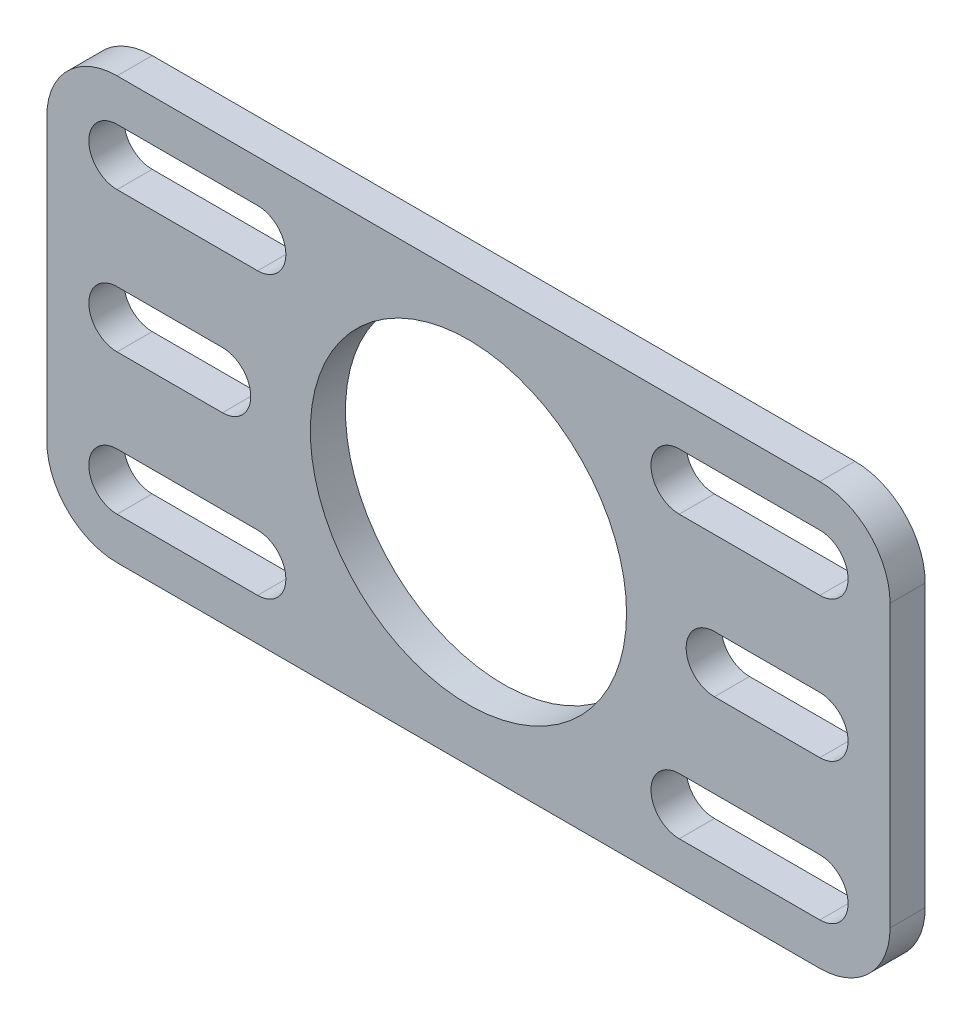
ISO-10303-21;
HEADER;
FILE_DESCRIPTION(('STEP AP214'),'2;1');
FILE_NAME('part.step','',(''),(''),'','','');
FILE_SCHEMA(('AUTOMOTIVE_DESIGN { 1 0 10303 214 1 1 1 1 }'));
ENDSEC;
DATA;
#1=APPLICATION_CONTEXT('core data for automotive mechanical design processes');
#2=APPLICATION_PROTOCOL_DEFINITION('international standard','automotive_design',2000,#1);
#3=PRODUCT_CONTEXT('',#1,'mechanical');
#4=PRODUCT('Part','Part','',(#3));
#5=PRODUCT_RELATED_PRODUCT_CATEGORY('part','',(#4));
#6=PRODUCT_DEFINITION_FORMATION('','',#4);
#7=PRODUCT_DEFINITION_CONTEXT('part definition',#1,'design');
#8=PRODUCT_DEFINITION('design','',#6,#7);
#9=PRODUCT_DEFINITION_SHAPE('','',#8);
#10=(LENGTH_UNIT() NAMED_UNIT(*) SI_UNIT(.MILLI.,.METRE.));
#11=(NAMED_UNIT(*) PLANE_ANGLE_UNIT() SI_UNIT($,.RADIAN.));
#12=(NAMED_UNIT(*) SI_UNIT($,.STERADIAN.) SOLID_ANGLE_UNIT());
#13=UNCERTAINTY_MEASURE_WITH_UNIT(LENGTH_MEASURE(1.E-05),#10,'distance_accuracy_value','');
#14=(GEOMETRIC_REPRESENTATION_CONTEXT(3) GLOBAL_UNCERTAINTY_ASSIGNED_CONTEXT((#13)) GLOBAL_UNIT_ASSIGNED_CONTEXT((#10,
#11,#12)) REPRESENTATION_CONTEXT('',''));
#15=CARTESIAN_POINT('',(0.,0.,0.));
#16=DIRECTION('',(0.,0.,1.));
#17=DIRECTION('',(1.,0.,0.));
#18=AXIS2_PLACEMENT_3D('',#15,#16,#17);
#19=CARTESIAN_POINT('',(0.,0.,0.));
#20=DIRECTION('',(0.,0.,1.));
#21=DIRECTION('',(1.,0.,0.));
#22=AXIS2_PLACEMENT_3D('',#19,#20,#21);
#23=PLANE('',#22);
#24=DIRECTION('',(1.,0.,0.));
#25=VECTOR('',#24,1.);
#26=CARTESIAN_POINT('',(-31.75,10.1473,0.));
#27=LINE('',#26,#25);
#28=CARTESIAN_POINT('',(-31.75,10.1473,0.));
#29=VERTEX_POINT('',#28);
#30=CARTESIAN_POINT('',(-19.05,10.1473,0.));
#31=VERTEX_POINT('',#30);
#32=EDGE_CURVE('E326',#29,#31,#27,.T.);
#33=ORIENTED_EDGE('',*,*,#32,.T.);
#34=CARTESIAN_POINT('',(-19.05,12.7,0.));
#35=DIRECTION('',(0.,0.,1.));
#36=DIRECTION('',(1.,0.,0.));
#37=AXIS2_PLACEMENT_3D('',#34,#35,#36);
#38=CIRCLE('',#37,2.5527);
#39=CARTESIAN_POINT('',(-19.05,15.2527,0.));
#40=VERTEX_POINT('',#39);
#41=EDGE_CURVE('E327',#31,#40,#38,.T.);
#42=ORIENTED_EDGE('',*,*,#41,.T.);
#43=DIRECTION('',(-1.,0.,0.));
#44=VECTOR('',#43,1.);
#45=CARTESIAN_POINT('',(-19.05,15.2527,0.));
#46=LINE('',#45,#44);
#47=CARTESIAN_POINT('',(-31.75,15.2527,0.));
#48=VERTEX_POINT('',#47);
#49=EDGE_CURVE('E395',#40,#48,#46,.T.);
#50=ORIENTED_EDGE('',*,*,#49,.T.);
#51=CARTESIAN_POINT('',(-31.75,12.7,0.));
#52=DIRECTION('',(0.,0.,1.));
#53=DIRECTION('',(1.,0.,0.));
#54=AXIS2_PLACEMENT_3D('',#51,#52,#53);
#55=CIRCLE('',#54,2.5527);
#56=EDGE_CURVE('E331',#48,#29,#55,.T.);
#57=ORIENTED_EDGE('',*,*,#56,.T.);
#58=EDGE_LOOP('',(#33,#42,#50,#57));
#59=FACE_BOUND('',#58,.T.);
#60=DIRECTION('',(-1.,0.,0.));
#61=VECTOR('',#60,1.);
#62=CARTESIAN_POINT('',(31.75,15.2527,0.));
#63=LINE('',#62,#61);
#64=CARTESIAN_POINT('',(31.75,15.2527,0.));
#65=VERTEX_POINT('',#64);
#66=CARTESIAN_POINT('',(19.05,15.2527,0.));
#67=VERTEX_POINT('',#66);
#68=EDGE_CURVE('E334',#65,#67,#63,.T.);
#69=ORIENTED_EDGE('',*,*,#68,.T.);
#70=CARTESIAN_POINT('',(19.05,12.7,0.));
#71=DIRECTION('',(0.,0.,1.));
#72=DIRECTION('',(1.,0.,0.));
#73=AXIS2_PLACEMENT_3D('',#70,#71,#72);
#74=CIRCLE('',#73,2.5527);
#75=CARTESIAN_POINT('',(19.05,10.1473,0.));
#76=VERTEX_POINT('',#75);
#77=EDGE_CURVE('E335',#67,#76,#74,.T.);
#78=ORIENTED_EDGE('',*,*,#77,.T.);
#79=DIRECTION('',(1.,0.,0.));
#80=VECTOR('',#79,1.);
#81=CARTESIAN_POINT('',(19.05,10.1473,0.));
#82=LINE('',#81,#80);
#83=CARTESIAN_POINT('',(31.75,10.1473,0.));
#84=VERTEX_POINT('',#83);
#85=EDGE_CURVE('E401',#76,#84,#82,.T.);
#86=ORIENTED_EDGE('',*,*,#85,.T.);
#87=CARTESIAN_POINT('',(31.75,12.7,0.));
#88=DIRECTION('',(0.,0.,1.));
#89=DIRECTION('',(1.,0.,0.));
#90=AXIS2_PLACEMENT_3D('',#87,#88,#89);
#91=CIRCLE('',#90,2.5527);
#92=EDGE_CURVE('E340',#84,#65,#91,.T.);
#93=ORIENTED_EDGE('',*,*,#92,.T.);
#94=EDGE_LOOP('',(#69,#78,#86,#93));
#95=FACE_BOUND('',#94,.T.);
#96=DIRECTION('',(-1.,0.,0.));
#97=VECTOR('',#96,1.);
#98=CARTESIAN_POINT('',(-19.05,-10.1473,0.));
#99=LINE('',#98,#97);
#100=CARTESIAN_POINT('',(-19.05,-10.1473,0.));
#101=VERTEX_POINT('',#100);
#102=CARTESIAN_POINT('',(-31.75,-10.1473,0.));
#103=VERTEX_POINT('',#102);
#104=EDGE_CURVE('E343',#101,#103,#99,.T.);
#105=ORIENTED_EDGE('',*,*,#104,.T.);
#106=CARTESIAN_POINT('',(-31.75,-12.7,0.));
#107=DIRECTION('',(0.,0.,1.));
#108=DIRECTION('',(1.,0.,0.));
#109=AXIS2_PLACEMENT_3D('',#106,#107,#108);
#110=CIRCLE('',#109,2.55269999999997);
#111=CARTESIAN_POINT('',(-31.75,-15.2527,0.));
#112=VERTEX_POINT('',#111);
#113=EDGE_CURVE('E344',#103,#112,#110,.T.);
#114=ORIENTED_EDGE('',*,*,#113,.T.);
#115=DIRECTION('',(1.,0.,0.));
#116=VECTOR('',#115,1.);
#117=CARTESIAN_POINT('',(-31.75,-15.2527,0.));
#118=LINE('',#117,#116);
#119=CARTESIAN_POINT('',(-19.05,-15.2527,0.));
#120=VERTEX_POINT('',#119);
#121=EDGE_CURVE('E407',#112,#120,#118,.T.);
#122=ORIENTED_EDGE('',*,*,#121,.T.);
#123=CARTESIAN_POINT('',(-19.05,-12.7,0.));
#124=DIRECTION('',(0.,0.,1.));
#125=DIRECTION('',(1.,0.,0.));
#126=AXIS2_PLACEMENT_3D('',#123,#124,#125);
#127=CIRCLE('',#126,2.55269999999997);
#128=EDGE_CURVE('E349',#120,#101,#127,.T.);
#129=ORIENTED_EDGE('',*,*,#128,.T.);
#130=EDGE_LOOP('',(#105,#114,#122,#129));
#131=FACE_BOUND('',#130,.T.);
#132=DIRECTION('',(1.,0.,0.));
#133=VECTOR('',#132,1.);
#134=CARTESIAN_POINT('',(19.05,-15.2527,0.));
#135=LINE('',#134,#133);
#136=CARTESIAN_POINT('',(19.05,-15.2527,0.));
#137=VERTEX_POINT('',#136);
#138=CARTESIAN_POINT('',(31.75,-15.2527,0.));
#139=VERTEX_POINT('',#138);
#140=EDGE_CURVE('E352',#137,#139,#135,.T.);
#141=ORIENTED_EDGE('',*,*,#140,.T.);
#142=CARTESIAN_POINT('',(31.75,-12.7,0.));
#143=DIRECTION('',(0.,0.,1.));
#144=DIRECTION('',(1.,0.,0.));
#145=AXIS2_PLACEMENT_3D('',#142,#143,#144);
#146=CIRCLE('',#145,2.55269999999997);
#147=CARTESIAN_POINT('',(31.75,-10.1473,0.));
#148=VERTEX_POINT('',#147);
#149=EDGE_CURVE('E353',#139,#148,#146,.T.);
#150=ORIENTED_EDGE('',*,*,#149,.T.);
#151=DIRECTION('',(-1.,0.,0.));
#152=VECTOR('',#151,1.);
#153=CARTESIAN_POINT('',(31.75,-10.1473,0.));
#154=LINE('',#153,#152);
#155=CARTESIAN_POINT('',(19.05,-10.1473,0.));
#156=VERTEX_POINT('',#155);
#157=EDGE_CURVE('E413',#148,#156,#154,.T.);
#158=ORIENTED_EDGE('',*,*,#157,.T.);
#159=CARTESIAN_POINT('',(19.05,-12.7,0.));
#160=DIRECTION('',(0.,0.,1.));
#161=DIRECTION('',(1.,0.,0.));
#162=AXIS2_PLACEMENT_3D('',#159,#160,#161);
#163=CIRCLE('',#162,2.55269999999997);
#164=EDGE_CURVE('E358',#156,#137,#163,.T.);
#165=ORIENTED_EDGE('',*,*,#164,.T.);
#166=EDGE_LOOP('',(#141,#150,#158,#165));
#167=FACE_BOUND('',#166,.T.);
#168=CARTESIAN_POINT('',(0.,0.,0.));
#169=DIRECTION('',(0.,0.,1.));
#170=DIRECTION('',(1.,0.,0.));
#171=AXIS2_PLACEMENT_3D('',#168,#169,#170);
#172=CIRCLE('',#171,14.2875);
#173=CARTESIAN_POINT('',(14.2875,0.,0.));
#174=VERTEX_POINT('',#173);
#175=EDGE_CURVE('E361',#174,#174,#172,.T.);
#176=ORIENTED_EDGE('',*,*,#175,.T.);
#177=EDGE_LOOP('',(#176));
#178=FACE_BOUND('',#177,.T.);
#179=DIRECTION('',(1.,0.,0.));
#180=VECTOR('',#179,1.);
#181=CARTESIAN_POINT('',(31.75,-2.55269999999997,0.));
#182=LINE('',#181,#180);
#183=CARTESIAN_POINT('',(22.225,-2.55269999999998,0.));
#184=VERTEX_POINT('',#183);
#185=CARTESIAN_POINT('',(31.75,-2.55269999999997,0.));
#186=VERTEX_POINT('',#185);
#187=EDGE_CURVE('E364',#184,#186,#182,.T.);
#188=ORIENTED_EDGE('',*,*,#187,.T.);
#189=CARTESIAN_POINT('',(31.75,0.,0.));
#190=DIRECTION('',(0.,0.,-1.));
#191=DIRECTION('',(-1.,0.,0.));
#192=AXIS2_PLACEMENT_3D('',#189,#190,#191);
#193=CIRCLE('',#192,2.55269999999997);
#194=CARTESIAN_POINT('',(31.75,2.55269999999998,0.));
#195=VERTEX_POINT('',#194);
#196=EDGE_CURVE('E365',#186,#195,#193,.F.);
#197=ORIENTED_EDGE('',*,*,#196,.T.);
#198=DIRECTION('',(-1.,0.,0.));
#199=VECTOR('',#198,1.);
#200=CARTESIAN_POINT('',(22.225,2.55269999999997,0.));
#201=LINE('',#200,#199);
#202=CARTESIAN_POINT('',(22.225,2.55269999999997,0.));
#203=VERTEX_POINT('',#202);
#204=EDGE_CURVE('E419',#195,#203,#201,.T.);
#205=ORIENTED_EDGE('',*,*,#204,.T.);
#206=CARTESIAN_POINT('',(22.225,0.,0.));
#207=DIRECTION('',(0.,0.,-1.));
#208=DIRECTION('',(-1.,0.,0.));
#209=AXIS2_PLACEMENT_3D('',#206,#207,#208);
#210=CIRCLE('',#209,2.55269999999997);
#211=EDGE_CURVE('E370',#203,#184,#210,.F.);
#212=ORIENTED_EDGE('',*,*,#211,.T.);
#213=EDGE_LOOP('',(#188,#197,#205,#212));
#214=FACE_BOUND('',#213,.T.);
#215=DIRECTION('',(-1.,0.,0.));
#216=VECTOR('',#215,1.);
#217=CARTESIAN_POINT('',(-31.75,2.5527,0.));
#218=LINE('',#217,#216);
#219=CARTESIAN_POINT('',(-22.225,2.55270000000001,0.));
#220=VERTEX_POINT('',#219);
#221=CARTESIAN_POINT('',(-31.75,2.5527,0.));
#222=VERTEX_POINT('',#221);
#223=EDGE_CURVE('E373',#220,#222,#218,.T.);
#224=ORIENTED_EDGE('',*,*,#223,.T.);
#225=CARTESIAN_POINT('',(-31.75,0.,0.));
#226=DIRECTION('',(0.,0.,-1.));
#227=DIRECTION('',(-1.,0.,0.));
#228=AXIS2_PLACEMENT_3D('',#225,#226,#227);
#229=CIRCLE('',#228,2.5527);
#230=CARTESIAN_POINT('',(-31.75,-2.55270000000001,0.));
#231=VERTEX_POINT('',#230);
#232=EDGE_CURVE('E374',#222,#231,#229,.F.);
#233=ORIENTED_EDGE('',*,*,#232,.T.);
#234=DIRECTION('',(1.,0.,0.));
#235=VECTOR('',#234,1.);
#236=CARTESIAN_POINT('',(-22.225,-2.5527,0.));
#237=LINE('',#236,#235);
#238=CARTESIAN_POINT('',(-22.225,-2.5527,0.));
#239=VERTEX_POINT('',#238);
#240=EDGE_CURVE('E251',#231,#239,#237,.T.);
#241=ORIENTED_EDGE('',*,*,#240,.T.);
#242=CARTESIAN_POINT('',(-22.225,0.,0.));
#243=DIRECTION('',(0.,0.,-1.));
#244=DIRECTION('',(-1.,0.,0.));
#245=AXIS2_PLACEMENT_3D('',#242,#243,#244);
#246=CIRCLE('',#245,2.5527);
#247=EDGE_CURVE('E244',#239,#220,#246,.F.);
#248=ORIENTED_EDGE('',*,*,#247,.T.);
#249=EDGE_LOOP('',(#224,#233,#241,#248));
#250=FACE_BOUND('',#249,.T.);
#251=DIRECTION('',(1.,0.,0.));
#252=VECTOR('',#251,1.);
#253=CARTESIAN_POINT('',(-38.1,-19.05,0.));
#254=LINE('',#253,#252);
#255=CARTESIAN_POINT('',(-31.75,-19.05,0.));
#256=VERTEX_POINT('',#255);
#257=CARTESIAN_POINT('',(31.75,-19.05,0.));
#258=VERTEX_POINT('',#257);
#259=EDGE_CURVE('E225',#256,#258,#254,.T.);
#260=ORIENTED_EDGE('',*,*,#259,.F.);
#261=CARTESIAN_POINT('',(-31.75,-12.7,0.));
#262=DIRECTION('',(0.,0.,1.));
#263=DIRECTION('',(1.,0.,0.));
#264=AXIS2_PLACEMENT_3D('',#261,#262,#263);
#265=CIRCLE('',#264,6.35);
#266=CARTESIAN_POINT('',(-38.1,-12.7,0.));
#267=VERTEX_POINT('',#266);
#268=EDGE_CURVE('E241',#267,#256,#265,.T.);
#269=ORIENTED_EDGE('',*,*,#268,.F.);
#270=DIRECTION('',(0.,-1.,0.));
#271=VECTOR('',#270,1.);
#272=CARTESIAN_POINT('',(-38.1,19.05,0.));
#273=LINE('',#272,#271);
#274=CARTESIAN_POINT('',(-38.1,12.7,0.));
#275=VERTEX_POINT('',#274);
#276=EDGE_CURVE('E253',#275,#267,#273,.T.);
#277=ORIENTED_EDGE('',*,*,#276,.F.);
#278=CARTESIAN_POINT('',(-31.75,12.7,0.));
#279=DIRECTION('',(0.,0.,1.));
#280=DIRECTION('',(1.,0.,0.));
#281=AXIS2_PLACEMENT_3D('',#278,#279,#280);
#282=CIRCLE('',#281,6.35);
#283=CARTESIAN_POINT('',(-31.75,19.05,0.));
#284=VERTEX_POINT('',#283);
#285=EDGE_CURVE('E380',#284,#275,#282,.T.);
#286=ORIENTED_EDGE('',*,*,#285,.F.);
#287=DIRECTION('',(-1.,0.,0.));
#288=VECTOR('',#287,1.);
#289=CARTESIAN_POINT('',(38.1,19.05,0.));
#290=LINE('',#289,#288);
#291=CARTESIAN_POINT('',(31.75,19.05,0.));
#292=VERTEX_POINT('',#291);
#293=EDGE_CURVE('E257',#292,#284,#290,.T.);
#294=ORIENTED_EDGE('',*,*,#293,.F.);
#295=CARTESIAN_POINT('',(31.75,12.7,0.));
#296=DIRECTION('',(0.,0.,1.));
#297=DIRECTION('',(1.,0.,0.));
#298=AXIS2_PLACEMENT_3D('',#295,#296,#297);
#299=CIRCLE('',#298,6.35);
#300=CARTESIAN_POINT('',(38.1,12.7,0.));
#301=VERTEX_POINT('',#300);
#302=EDGE_CURVE('E381',#301,#292,#299,.T.);
#303=ORIENTED_EDGE('',*,*,#302,.F.);
#304=DIRECTION('',(0.,1.,0.));
#305=VECTOR('',#304,1.);
#306=CARTESIAN_POINT('',(38.1,-19.05,0.));
#307=LINE('',#306,#305);
#308=CARTESIAN_POINT('',(38.1,-12.7,0.));
#309=VERTEX_POINT('',#308);
#310=EDGE_CURVE('E228',#309,#301,#307,.T.);
#311=ORIENTED_EDGE('',*,*,#310,.F.);
#312=CARTESIAN_POINT('',(31.75,-12.7,0.));
#313=DIRECTION('',(0.,0.,1.));
#314=DIRECTION('',(1.,0.,0.));
#315=AXIS2_PLACEMENT_3D('',#312,#313,#314);
#316=CIRCLE('',#315,6.35);
#317=EDGE_CURVE('E18',#258,#309,#316,.T.);
#318=ORIENTED_EDGE('',*,*,#317,.F.);
#319=EDGE_LOOP('',(#260,#269,#277,#286,#294,#303,#311,#318));
#320=FACE_BOUND('',#319,.T.);
#321=ADVANCED_FACE('F15',(#59,#95,#131,#167,#178,#214,#250,#320),#23,.F.);
#322=CARTESIAN_POINT('',(31.75,-12.7,0.));
#323=DIRECTION('',(0.,0.,1.));
#324=DIRECTION('',(1.,0.,0.));
#325=AXIS2_PLACEMENT_3D('',#322,#323,#324);
#326=CYLINDRICAL_SURFACE('',#325,6.35);
#327=ORIENTED_EDGE('',*,*,#317,.T.);
#328=DIRECTION('',(0.,0.,1.));
#329=VECTOR('',#328,1.);
#330=CARTESIAN_POINT('',(38.1,-12.7,0.));
#331=LINE('',#330,#329);
#332=CARTESIAN_POINT('',(38.1,-12.7,3.175));
#333=VERTEX_POINT('',#332);
#334=EDGE_CURVE('E231',#333,#309,#331,.F.);
#335=ORIENTED_EDGE('',*,*,#334,.F.);
#336=CARTESIAN_POINT('',(31.75,-12.7,3.175));
#337=DIRECTION('',(0.,0.,1.));
#338=DIRECTION('',(1.,0.,0.));
#339=AXIS2_PLACEMENT_3D('',#336,#337,#338);
#340=CIRCLE('',#339,6.35);
#341=CARTESIAN_POINT('',(31.75,-19.05,3.175));
#342=VERTEX_POINT('',#341);
#343=EDGE_CURVE('E236',#342,#333,#340,.T.);
#344=ORIENTED_EDGE('',*,*,#343,.F.);
#345=DIRECTION('',(0.,0.,-1.));
#346=VECTOR('',#345,1.);
#347=CARTESIAN_POINT('',(31.75,-19.05,0.));
#348=LINE('',#347,#346);
#349=EDGE_CURVE('E233',#258,#342,#348,.F.);
#350=ORIENTED_EDGE('',*,*,#349,.F.);
#351=EDGE_LOOP('',(#327,#335,#344,#350));
#352=FACE_BOUND('',#351,.T.);
#353=ADVANCED_FACE('F234',(#352),#326,.T.);
#354=CARTESIAN_POINT('',(38.1,-19.05,0.));
#355=DIRECTION('',(1.,0.,0.));
#356=DIRECTION('',(0.,1.,0.));
#357=AXIS2_PLACEMENT_3D('',#354,#355,#356);
#358=PLANE('',#357);
#359=DIRECTION('',(0.,0.,1.));
#360=VECTOR('',#359,1.);
#361=CARTESIAN_POINT('',(38.1,12.7,0.));
#362=LINE('',#361,#360);
#363=CARTESIAN_POINT('',(38.1,12.7,3.175));
#364=VERTEX_POINT('',#363);
#365=EDGE_CURVE('E262',#364,#301,#362,.F.);
#366=ORIENTED_EDGE('',*,*,#365,.F.);
#367=DIRECTION('',(0.,1.,0.));
#368=VECTOR('',#367,1.);
#369=CARTESIAN_POINT('',(38.1,0.,3.175));
#370=LINE('',#369,#368);
#371=EDGE_CURVE('E324',#333,#364,#370,.T.);
#372=ORIENTED_EDGE('',*,*,#371,.F.);
#373=ORIENTED_EDGE('',*,*,#334,.T.);
#374=ORIENTED_EDGE('',*,*,#310,.T.);
#375=EDGE_LOOP('',(#366,#372,#373,#374));
#376=FACE_BOUND('',#375,.T.);
#377=ADVANCED_FACE('F631',(#376),#358,.T.);
#378=CARTESIAN_POINT('',(31.75,12.7,0.));
#379=DIRECTION('',(0.,0.,1.));
#380=DIRECTION('',(1.,0.,0.));
#381=AXIS2_PLACEMENT_3D('',#378,#379,#380);
#382=CYLINDRICAL_SURFACE('',#381,6.35);
#383=ORIENTED_EDGE('',*,*,#302,.T.);
#384=DIRECTION('',(0.,0.,1.));
#385=VECTOR('',#384,1.);
#386=CARTESIAN_POINT('',(31.75,19.05,0.));
#387=LINE('',#386,#385);
#388=CARTESIAN_POINT('',(31.75,19.05,3.175));
#389=VERTEX_POINT('',#388);
#390=EDGE_CURVE('E260',#389,#292,#387,.F.);
#391=ORIENTED_EDGE('',*,*,#390,.F.);
#392=CARTESIAN_POINT('',(31.75,12.7,3.175));
#393=DIRECTION('',(0.,0.,1.));
#394=DIRECTION('',(1.,0.,0.));
#395=AXIS2_PLACEMENT_3D('',#392,#393,#394);
#396=CIRCLE('',#395,6.35);
#397=EDGE_CURVE('E321',#364,#389,#396,.T.);
#398=ORIENTED_EDGE('',*,*,#397,.F.);
#399=ORIENTED_EDGE('',*,*,#365,.T.);
#400=EDGE_LOOP('',(#383,#391,#398,#399));
#401=FACE_BOUND('',#400,.T.);
#402=ADVANCED_FACE('F688',(#401),#382,.T.);
#403=CARTESIAN_POINT('',(38.1,19.05,0.));
#404=DIRECTION('',(0.,1.,0.));
#405=DIRECTION('',(-1.,0.,0.));
#406=AXIS2_PLACEMENT_3D('',#403,#404,#405);
#407=PLANE('',#406);
#408=ORIENTED_EDGE('',*,*,#390,.T.);
#409=ORIENTED_EDGE('',*,*,#293,.T.);
#410=DIRECTION('',(0.,0.,1.));
#411=VECTOR('',#410,1.);
#412=CARTESIAN_POINT('',(-31.75,19.05,0.));
#413=LINE('',#412,#411);
#414=CARTESIAN_POINT('',(-31.75,19.05,3.175));
#415=VERTEX_POINT('',#414);
#416=EDGE_CURVE('E259',#415,#284,#413,.F.);
#417=ORIENTED_EDGE('',*,*,#416,.F.);
#418=DIRECTION('',(1.,0.,0.));
#419=VECTOR('',#418,1.);
#420=CARTESIAN_POINT('',(0.,19.05,3.175));
#421=LINE('',#420,#419);
#422=EDGE_CURVE('E320',#389,#415,#421,.F.);
#423=ORIENTED_EDGE('',*,*,#422,.F.);
#424=EDGE_LOOP('',(#408,#409,#417,#423));
#425=FACE_BOUND('',#424,.T.);
#426=ADVANCED_FACE('F447',(#425),#407,.T.);
#427=CARTESIAN_POINT('',(-31.75,12.7,0.));
#428=DIRECTION('',(0.,0.,1.));
#429=DIRECTION('',(1.,0.,0.));
#430=AXIS2_PLACEMENT_3D('',#427,#428,#429);
#431=CYLINDRICAL_SURFACE('',#430,6.35);
#432=ORIENTED_EDGE('',*,*,#285,.T.);
#433=DIRECTION('',(0.,0.,1.));
#434=VECTOR('',#433,1.);
#435=CARTESIAN_POINT('',(-38.1,12.7,0.));
#436=LINE('',#435,#434);
#437=CARTESIAN_POINT('',(-38.1,12.7,3.175));
#438=VERTEX_POINT('',#437);
#439=EDGE_CURVE('E256',#438,#275,#436,.F.);
#440=ORIENTED_EDGE('',*,*,#439,.F.);
#441=CARTESIAN_POINT('',(-31.75,12.7,3.175));
#442=DIRECTION('',(0.,0.,1.));
#443=DIRECTION('',(1.,0.,0.));
#444=AXIS2_PLACEMENT_3D('',#441,#442,#443);
#445=CIRCLE('',#444,6.35);
#446=EDGE_CURVE('E317',#415,#438,#445,.T.);
#447=ORIENTED_EDGE('',*,*,#446,.F.);
#448=ORIENTED_EDGE('',*,*,#416,.T.);
#449=EDGE_LOOP('',(#432,#440,#447,#448));
#450=FACE_BOUND('',#449,.T.);
#451=ADVANCED_FACE('F441',(#450),#431,.T.);
#452=CARTESIAN_POINT('',(-38.1,19.05,0.));
#453=DIRECTION('',(-1.,0.,0.));
#454=DIRECTION('',(0.,-1.,0.));
#455=AXIS2_PLACEMENT_3D('',#452,#453,#454);
#456=PLANE('',#455);
#457=ORIENTED_EDGE('',*,*,#439,.T.);
#458=ORIENTED_EDGE('',*,*,#276,.T.);
#459=DIRECTION('',(0.,0.,1.));
#460=VECTOR('',#459,1.);
#461=CARTESIAN_POINT('',(-38.1,-12.7,0.));
#462=LINE('',#461,#460);
#463=CARTESIAN_POINT('',(-38.1,-12.7,3.175));
#464=VERTEX_POINT('',#463);
#465=EDGE_CURVE('E255',#464,#267,#462,.F.);
#466=ORIENTED_EDGE('',*,*,#465,.F.);
#467=DIRECTION('',(0.,1.,0.));
#468=VECTOR('',#467,1.);
#469=CARTESIAN_POINT('',(-38.1,0.,3.175));
#470=LINE('',#469,#468);
#471=EDGE_CURVE('E316',#438,#464,#470,.F.);
#472=ORIENTED_EDGE('',*,*,#471,.F.);
#473=EDGE_LOOP('',(#457,#458,#466,#472));
#474=FACE_BOUND('',#473,.T.);
#475=ADVANCED_FACE('F450',(#474),#456,.T.);
#476=CARTESIAN_POINT('',(-31.75,-12.7,0.));
#477=DIRECTION('',(0.,0.,1.));
#478=DIRECTION('',(1.,0.,0.));
#479=AXIS2_PLACEMENT_3D('',#476,#477,#478);
#480=CYLINDRICAL_SURFACE('',#479,6.35);
#481=ORIENTED_EDGE('',*,*,#268,.T.);
#482=DIRECTION('',(0.,0.,-1.));
#483=VECTOR('',#482,1.);
#484=CARTESIAN_POINT('',(-31.75,-19.05,0.));
#485=LINE('',#484,#483);
#486=CARTESIAN_POINT('',(-31.75,-19.05,3.175));
#487=VERTEX_POINT('',#486);
#488=EDGE_CURVE('E240',#487,#256,#485,.T.);
#489=ORIENTED_EDGE('',*,*,#488,.F.);
#490=CARTESIAN_POINT('',(-31.75,-12.7,3.175));
#491=DIRECTION('',(0.,0.,1.));
#492=DIRECTION('',(1.,0.,0.));
#493=AXIS2_PLACEMENT_3D('',#490,#491,#492);
#494=CIRCLE('',#493,6.35);
#495=EDGE_CURVE('E313',#464,#487,#494,.T.);
#496=ORIENTED_EDGE('',*,*,#495,.F.);
#497=ORIENTED_EDGE('',*,*,#465,.T.);
#498=EDGE_LOOP('',(#481,#489,#496,#497));
#499=FACE_BOUND('',#498,.T.);
#500=ADVANCED_FACE('F509',(#499),#480,.T.);
#501=CARTESIAN_POINT('',(-38.1,-19.05,0.));
#502=DIRECTION('',(0.,-1.,0.));
#503=DIRECTION('',(0.,0.,-1.));
#504=AXIS2_PLACEMENT_3D('',#501,#502,#503);
#505=PLANE('',#504);
#506=ORIENTED_EDGE('',*,*,#488,.T.);
#507=ORIENTED_EDGE('',*,*,#259,.T.);
#508=ORIENTED_EDGE('',*,*,#349,.T.);
#509=DIRECTION('',(1.,0.,0.));
#510=VECTOR('',#509,1.);
#511=CARTESIAN_POINT('',(0.,-19.05,3.175));
#512=LINE('',#511,#510);
#513=EDGE_CURVE('E312',#487,#342,#512,.T.);
#514=ORIENTED_EDGE('',*,*,#513,.F.);
#515=EDGE_LOOP('',(#506,#507,#508,#514));
#516=FACE_BOUND('',#515,.T.);
#517=ADVANCED_FACE('F243',(#516),#505,.T.);
#518=CARTESIAN_POINT('',(-22.225,0.,3.175));
#519=DIRECTION('',(0.,0.,-1.));
#520=DIRECTION('',(-1.,0.,0.));
#521=AXIS2_PLACEMENT_3D('',#518,#519,#520);
#522=CYLINDRICAL_SURFACE('',#521,2.5527);
#523=DIRECTION('',(0.,0.,1.));
#524=VECTOR('',#523,1.);
#525=CARTESIAN_POINT('',(-22.225,-2.5527,3.175));
#526=LINE('',#525,#524);
#527=CARTESIAN_POINT('',(-22.225,-2.5527,3.175));
#528=VERTEX_POINT('',#527);
#529=EDGE_CURVE('E246',#239,#528,#526,.T.);
#530=ORIENTED_EDGE('',*,*,#529,.T.);
#531=CARTESIAN_POINT('',(-22.225,0.,3.175));
#532=DIRECTION('',(0.,0.,-1.));
#533=DIRECTION('',(-1.,0.,0.));
#534=AXIS2_PLACEMENT_3D('',#531,#532,#533);
#535=CIRCLE('',#534,2.5527);
#536=CARTESIAN_POINT('',(-22.225,2.5527,3.175));
#537=VERTEX_POINT('',#536);
#538=EDGE_CURVE('E309',#537,#528,#535,.T.);
#539=ORIENTED_EDGE('',*,*,#538,.F.);
#540=DIRECTION('',(0.,0.,1.));
#541=VECTOR('',#540,1.);
#542=CARTESIAN_POINT('',(-22.225,2.55270000000001,3.175));
#543=LINE('',#542,#541);
#544=EDGE_CURVE('E422',#537,#220,#543,.F.);
#545=ORIENTED_EDGE('',*,*,#544,.T.);
#546=ORIENTED_EDGE('',*,*,#247,.F.);
#547=EDGE_LOOP('',(#530,#539,#545,#546));
#548=FACE_BOUND('',#547,.T.);
#549=ADVANCED_FACE('F517',(#548),#522,.F.);
#550=CARTESIAN_POINT('',(-22.225,-2.5527,3.175));
#551=DIRECTION('',(0.,-1.,0.));
#552=DIRECTION('',(1.,0.,0.));
#553=AXIS2_PLACEMENT_3D('',#550,#551,#552);
#554=PLANE('',#553);
#555=DIRECTION('',(0.,0.,-1.));
#556=VECTOR('',#555,1.);
#557=CARTESIAN_POINT('',(-31.75,-2.55270000000001,3.175));
#558=LINE('',#557,#556);
#559=CARTESIAN_POINT('',(-31.75,-2.5527,3.175));
#560=VERTEX_POINT('',#559);
#561=EDGE_CURVE('E377',#231,#560,#558,.F.);
#562=ORIENTED_EDGE('',*,*,#561,.T.);
#563=DIRECTION('',(1.,0.,0.));
#564=VECTOR('',#563,1.);
#565=CARTESIAN_POINT('',(0.,-2.5527,3.175));
#566=LINE('',#565,#564);
#567=EDGE_CURVE('E308',#528,#560,#566,.F.);
#568=ORIENTED_EDGE('',*,*,#567,.F.);
#569=ORIENTED_EDGE('',*,*,#529,.F.);
#570=ORIENTED_EDGE('',*,*,#240,.F.);
#571=EDGE_LOOP('',(#562,#568,#569,#570));
#572=FACE_BOUND('',#571,.T.);
#573=ADVANCED_FACE('F612',(#572),#554,.F.);
#574=CARTESIAN_POINT('',(-31.75,0.,3.175));
#575=DIRECTION('',(0.,0.,-1.));
#576=DIRECTION('',(-1.,0.,0.));
#577=AXIS2_PLACEMENT_3D('',#574,#575,#576);
#578=CYLINDRICAL_SURFACE('',#577,2.5527);
#579=DIRECTION('',(0.,0.,1.));
#580=VECTOR('',#579,1.);
#581=CARTESIAN_POINT('',(-31.75,2.5527,3.175));
#582=LINE('',#581,#580);
#583=CARTESIAN_POINT('',(-31.75,2.5527,3.175));
#584=VERTEX_POINT('',#583);
#585=EDGE_CURVE('E376',#222,#584,#582,.T.);
#586=ORIENTED_EDGE('',*,*,#585,.T.);
#587=CARTESIAN_POINT('',(-31.75,0.,3.175));
#588=DIRECTION('',(0.,0.,-1.));
#589=DIRECTION('',(-1.,0.,0.));
#590=AXIS2_PLACEMENT_3D('',#587,#588,#589);
#591=CIRCLE('',#590,2.5527);
#592=EDGE_CURVE('E305',#560,#584,#591,.T.);
#593=ORIENTED_EDGE('',*,*,#592,.F.);
#594=ORIENTED_EDGE('',*,*,#561,.F.);
#595=ORIENTED_EDGE('',*,*,#232,.F.);
#596=EDGE_LOOP('',(#586,#593,#594,#595));
#597=FACE_BOUND('',#596,.T.);
#598=ADVANCED_FACE('F608',(#597),#578,.F.);
#599=CARTESIAN_POINT('',(-31.75,2.5527,3.175));
#600=DIRECTION('',(0.,1.,0.));
#601=DIRECTION('',(-1.,0.,0.));
#602=AXIS2_PLACEMENT_3D('',#599,#600,#601);
#603=PLANE('',#602);
#604=ORIENTED_EDGE('',*,*,#544,.F.);
#605=DIRECTION('',(1.,0.,0.));
#606=VECTOR('',#605,1.);
#607=CARTESIAN_POINT('',(0.,2.5527,3.175));
#608=LINE('',#607,#606);
#609=EDGE_CURVE('E304',#584,#537,#608,.T.);
#610=ORIENTED_EDGE('',*,*,#609,.F.);
#611=ORIENTED_EDGE('',*,*,#585,.F.);
#612=ORIENTED_EDGE('',*,*,#223,.F.);
#613=EDGE_LOOP('',(#604,#610,#611,#612));
#614=FACE_BOUND('',#613,.T.);
#615=ADVANCED_FACE('F605',(#614),#603,.F.);
#616=CARTESIAN_POINT('',(22.225,0.,3.175));
#617=DIRECTION('',(0.,0.,-1.));
#618=DIRECTION('',(-1.,0.,0.));
#619=AXIS2_PLACEMENT_3D('',#616,#617,#618);
#620=CYLINDRICAL_SURFACE('',#619,2.55269999999997);
#621=DIRECTION('',(0.,0.,1.));
#622=VECTOR('',#621,1.);
#623=CARTESIAN_POINT('',(22.225,2.55269999999997,3.175));
#624=LINE('',#623,#622);
#625=CARTESIAN_POINT('',(22.225,2.55269999999997,3.175));
#626=VERTEX_POINT('',#625);
#627=EDGE_CURVE('E372',#203,#626,#624,.T.);
#628=ORIENTED_EDGE('',*,*,#627,.T.);
#629=CARTESIAN_POINT('',(22.225,0.,3.175));
#630=DIRECTION('',(0.,0.,-1.));
#631=DIRECTION('',(-1.,0.,0.));
#632=AXIS2_PLACEMENT_3D('',#629,#630,#631);
#633=CIRCLE('',#632,2.55269999999997);
#634=CARTESIAN_POINT('',(22.225,-2.55269999999998,3.175));
#635=VERTEX_POINT('',#634);
#636=EDGE_CURVE('E301',#635,#626,#633,.T.);
#637=ORIENTED_EDGE('',*,*,#636,.F.);
#638=DIRECTION('',(0.,0.,1.));
#639=VECTOR('',#638,1.);
#640=CARTESIAN_POINT('',(22.225,-2.55269999999998,3.175));
#641=LINE('',#640,#639);
#642=EDGE_CURVE('E418',#635,#184,#641,.F.);
#643=ORIENTED_EDGE('',*,*,#642,.T.);
#644=ORIENTED_EDGE('',*,*,#211,.F.);
#645=EDGE_LOOP('',(#628,#637,#643,#644));
#646=FACE_BOUND('',#645,.T.);
#647=ADVANCED_FACE('F487',(#646),#620,.F.);
#648=CARTESIAN_POINT('',(22.225,2.55269999999997,3.175));
#649=DIRECTION('',(0.,1.,0.));
#650=DIRECTION('',(-1.,0.,0.));
#651=AXIS2_PLACEMENT_3D('',#648,#649,#650);
#652=PLANE('',#651);
#653=DIRECTION('',(0.,0.,-1.));
#654=VECTOR('',#653,1.);
#655=CARTESIAN_POINT('',(31.75,2.55269999999998,3.175));
#656=LINE('',#655,#654);
#657=CARTESIAN_POINT('',(31.75,2.55269999999998,3.175));
#658=VERTEX_POINT('',#657);
#659=EDGE_CURVE('E369',#195,#658,#656,.F.);
#660=ORIENTED_EDGE('',*,*,#659,.T.);
#661=DIRECTION('',(1.,0.,0.));
#662=VECTOR('',#661,1.);
#663=CARTESIAN_POINT('',(0.,2.55269999999997,3.175));
#664=LINE('',#663,#662);
#665=EDGE_CURVE('E300',#626,#658,#664,.T.);
#666=ORIENTED_EDGE('',*,*,#665,.F.);
#667=ORIENTED_EDGE('',*,*,#627,.F.);
#668=ORIENTED_EDGE('',*,*,#204,.F.);
#669=EDGE_LOOP('',(#660,#666,#667,#668));
#670=FACE_BOUND('',#669,.T.);
#671=ADVANCED_FACE('F491',(#670),#652,.F.);
#672=CARTESIAN_POINT('',(31.75,0.,3.175));
#673=DIRECTION('',(0.,0.,-1.));
#674=DIRECTION('',(-1.,0.,0.));
#675=AXIS2_PLACEMENT_3D('',#672,#673,#674);
#676=CYLINDRICAL_SURFACE('',#675,2.55269999999997);
#677=DIRECTION('',(0.,0.,1.));
#678=VECTOR('',#677,1.);
#679=CARTESIAN_POINT('',(31.75,-2.55269999999997,3.175));
#680=LINE('',#679,#678);
#681=CARTESIAN_POINT('',(31.75,-2.55269999999997,3.175));
#682=VERTEX_POINT('',#681);
#683=EDGE_CURVE('E368',#186,#682,#680,.T.);
#684=ORIENTED_EDGE('',*,*,#683,.T.);
#685=CARTESIAN_POINT('',(31.75,0.,3.175));
#686=DIRECTION('',(0.,0.,-1.));
#687=DIRECTION('',(-1.,0.,0.));
#688=AXIS2_PLACEMENT_3D('',#685,#686,#687);
#689=CIRCLE('',#688,2.55269999999997);
#690=EDGE_CURVE('E297',#658,#682,#689,.T.);
#691=ORIENTED_EDGE('',*,*,#690,.F.);
#692=ORIENTED_EDGE('',*,*,#659,.F.);
#693=ORIENTED_EDGE('',*,*,#196,.F.);
#694=EDGE_LOOP('',(#684,#691,#692,#693));
#695=FACE_BOUND('',#694,.T.);
#696=ADVANCED_FACE('F597',(#695),#676,.F.);
#697=CARTESIAN_POINT('',(31.75,-2.55269999999997,3.175));
#698=DIRECTION('',(0.,-1.,0.));
#699=DIRECTION('',(1.,0.,0.));
#700=AXIS2_PLACEMENT_3D('',#697,#698,#699);
#701=PLANE('',#700);
#702=ORIENTED_EDGE('',*,*,#642,.F.);
#703=DIRECTION('',(1.,0.,0.));
#704=VECTOR('',#703,1.);
#705=CARTESIAN_POINT('',(0.,-2.55269999999997,3.175));
#706=LINE('',#705,#704);
#707=EDGE_CURVE('E296',#682,#635,#706,.F.);
#708=ORIENTED_EDGE('',*,*,#707,.F.);
#709=ORIENTED_EDGE('',*,*,#683,.F.);
#710=ORIENTED_EDGE('',*,*,#187,.F.);
#711=EDGE_LOOP('',(#702,#708,#709,#710));
#712=FACE_BOUND('',#711,.T.);
#713=ADVANCED_FACE('F593',(#712),#701,.F.);
#714=CARTESIAN_POINT('',(0.,0.,0.));
#715=DIRECTION('',(0.,0.,1.));
#716=DIRECTION('',(1.,0.,0.));
#717=AXIS2_PLACEMENT_3D('',#714,#715,#716);
#718=CYLINDRICAL_SURFACE('',#717,14.2875);
#719=ORIENTED_EDGE('',*,*,#175,.F.);
#720=EDGE_LOOP('',(#719));
#721=FACE_BOUND('',#720,.T.);
#722=CARTESIAN_POINT('',(0.,0.,3.175));
#723=DIRECTION('',(0.,0.,1.));
#724=DIRECTION('',(1.,0.,0.));
#725=AXIS2_PLACEMENT_3D('',#722,#723,#724);
#726=CIRCLE('',#725,14.2875);
#727=CARTESIAN_POINT('',(14.2875,0.,3.175));
#728=VERTEX_POINT('',#727);
#729=EDGE_CURVE('E293',#728,#728,#726,.F.);
#730=ORIENTED_EDGE('',*,*,#729,.F.);
#731=EDGE_LOOP('',(#730));
#732=FACE_BOUND('',#731,.T.);
#733=ADVANCED_FACE('F589',(#721,#732),#718,.F.);
#734=CARTESIAN_POINT('',(19.05,-12.7,0.));
#735=DIRECTION('',(0.,0.,1.));
#736=DIRECTION('',(1.,0.,0.));
#737=AXIS2_PLACEMENT_3D('',#734,#735,#736);
#738=CYLINDRICAL_SURFACE('',#737,2.55269999999997);
#739=DIRECTION('',(0.,0.,1.));
#740=VECTOR('',#739,1.);
#741=CARTESIAN_POINT('',(19.05,-10.1473,0.));
#742=LINE('',#741,#740);
#743=CARTESIAN_POINT('',(19.05,-10.1473,3.175));
#744=VERTEX_POINT('',#743);
#745=EDGE_CURVE('E360',#156,#744,#742,.T.);
#746=ORIENTED_EDGE('',*,*,#745,.T.);
#747=CARTESIAN_POINT('',(19.05,-12.7,3.175));
#748=DIRECTION('',(0.,0.,1.));
#749=DIRECTION('',(1.,0.,0.));
#750=AXIS2_PLACEMENT_3D('',#747,#748,#749);
#751=CIRCLE('',#750,2.55269999999997);
#752=CARTESIAN_POINT('',(19.05,-15.2527,3.175));
#753=VERTEX_POINT('',#752);
#754=EDGE_CURVE('E290',#753,#744,#751,.F.);
#755=ORIENTED_EDGE('',*,*,#754,.F.);
#756=DIRECTION('',(0.,0.,1.));
#757=VECTOR('',#756,1.);
#758=CARTESIAN_POINT('',(19.05,-15.2527,0.));
#759=LINE('',#758,#757);
#760=EDGE_CURVE('E412',#753,#137,#759,.F.);
#761=ORIENTED_EDGE('',*,*,#760,.T.);
#762=ORIENTED_EDGE('',*,*,#164,.F.);
#763=EDGE_LOOP('',(#746,#755,#761,#762));
#764=FACE_BOUND('',#763,.T.);
#765=ADVANCED_FACE('F585',(#764),#738,.F.);
#766=CARTESIAN_POINT('',(31.75,-10.1473,0.));
#767=DIRECTION('',(0.,1.,0.));
#768=DIRECTION('',(-1.,0.,0.));
#769=AXIS2_PLACEMENT_3D('',#766,#767,#768);
#770=PLANE('',#769);
#771=DIRECTION('',(0.,0.,1.));
#772=VECTOR('',#771,1.);
#773=CARTESIAN_POINT('',(31.75,-10.1473,0.));
#774=LINE('',#773,#772);
#775=CARTESIAN_POINT('',(31.75,-10.1473,3.175));
#776=VERTEX_POINT('',#775);
#777=EDGE_CURVE('E357',#148,#776,#774,.T.);
#778=ORIENTED_EDGE('',*,*,#777,.T.);
#779=DIRECTION('',(1.,0.,0.));
#780=VECTOR('',#779,1.);
#781=CARTESIAN_POINT('',(0.,-10.1473,3.175));
#782=LINE('',#781,#780);
#783=EDGE_CURVE('E289',#744,#776,#782,.T.);
#784=ORIENTED_EDGE('',*,*,#783,.F.);
#785=ORIENTED_EDGE('',*,*,#745,.F.);
#786=ORIENTED_EDGE('',*,*,#157,.F.);
#787=EDGE_LOOP('',(#778,#784,#785,#786));
#788=FACE_BOUND('',#787,.T.);
#789=ADVANCED_FACE('F581',(#788),#770,.F.);
#790=CARTESIAN_POINT('',(31.75,-12.7,0.));
#791=DIRECTION('',(0.,0.,1.));
#792=DIRECTION('',(1.,0.,0.));
#793=AXIS2_PLACEMENT_3D('',#790,#791,#792);
#794=CYLINDRICAL_SURFACE('',#793,2.55269999999997);
#795=DIRECTION('',(0.,0.,1.));
#796=VECTOR('',#795,1.);
#797=CARTESIAN_POINT('',(31.75,-15.2527,0.));
#798=LINE('',#797,#796);
#799=CARTESIAN_POINT('',(31.75,-15.2527,3.175));
#800=VERTEX_POINT('',#799);
#801=EDGE_CURVE('E356',#139,#800,#798,.T.);
#802=ORIENTED_EDGE('',*,*,#801,.T.);
#803=CARTESIAN_POINT('',(31.75,-12.7,3.175));
#804=DIRECTION('',(0.,0.,1.));
#805=DIRECTION('',(1.,0.,0.));
#806=AXIS2_PLACEMENT_3D('',#803,#804,#805);
#807=CIRCLE('',#806,2.55269999999997);
#808=EDGE_CURVE('E286',#776,#800,#807,.F.);
#809=ORIENTED_EDGE('',*,*,#808,.F.);
#810=ORIENTED_EDGE('',*,*,#777,.F.);
#811=ORIENTED_EDGE('',*,*,#149,.F.);
#812=EDGE_LOOP('',(#802,#809,#810,#811));
#813=FACE_BOUND('',#812,.T.);
#814=ADVANCED_FACE('F577',(#813),#794,.F.);
#815=CARTESIAN_POINT('',(19.05,-15.2527,0.));
#816=DIRECTION('',(0.,-1.,0.));
#817=DIRECTION('',(1.,0.,0.));
#818=AXIS2_PLACEMENT_3D('',#815,#816,#817);
#819=PLANE('',#818);
#820=ORIENTED_EDGE('',*,*,#760,.F.);
#821=DIRECTION('',(1.,0.,0.));
#822=VECTOR('',#821,1.);
#823=CARTESIAN_POINT('',(0.,-15.2527,3.175));
#824=LINE('',#823,#822);
#825=EDGE_CURVE('E285',#800,#753,#824,.F.);
#826=ORIENTED_EDGE('',*,*,#825,.F.);
#827=ORIENTED_EDGE('',*,*,#801,.F.);
#828=ORIENTED_EDGE('',*,*,#140,.F.);
#829=EDGE_LOOP('',(#820,#826,#827,#828));
#830=FACE_BOUND('',#829,.T.);
#831=ADVANCED_FACE('F573',(#830),#819,.F.);
#832=CARTESIAN_POINT('',(-19.05,-12.7,0.));
#833=DIRECTION('',(0.,0.,1.));
#834=DIRECTION('',(1.,0.,0.));
#835=AXIS2_PLACEMENT_3D('',#832,#833,#834);
#836=CYLINDRICAL_SURFACE('',#835,2.55269999999997);
#837=DIRECTION('',(0.,0.,1.));
#838=VECTOR('',#837,1.);
#839=CARTESIAN_POINT('',(-19.05,-15.2527,0.));
#840=LINE('',#839,#838);
#841=CARTESIAN_POINT('',(-19.05,-15.2527,3.175));
#842=VERTEX_POINT('',#841);
#843=EDGE_CURVE('E351',#120,#842,#840,.T.);
#844=ORIENTED_EDGE('',*,*,#843,.T.);
#845=CARTESIAN_POINT('',(-19.05,-12.7,3.175));
#846=DIRECTION('',(0.,0.,1.));
#847=DIRECTION('',(1.,0.,0.));
#848=AXIS2_PLACEMENT_3D('',#845,#846,#847);
#849=CIRCLE('',#848,2.55269999999997);
#850=CARTESIAN_POINT('',(-19.05,-10.1473,3.175));
#851=VERTEX_POINT('',#850);
#852=EDGE_CURVE('E282',#851,#842,#849,.F.);
#853=ORIENTED_EDGE('',*,*,#852,.F.);
#854=DIRECTION('',(0.,0.,1.));
#855=VECTOR('',#854,1.);
#856=CARTESIAN_POINT('',(-19.05,-10.1473,0.));
#857=LINE('',#856,#855);
#858=EDGE_CURVE('E406',#851,#101,#857,.F.);
#859=ORIENTED_EDGE('',*,*,#858,.T.);
#860=ORIENTED_EDGE('',*,*,#128,.F.);
#861=EDGE_LOOP('',(#844,#853,#859,#860));
#862=FACE_BOUND('',#861,.T.);
#863=ADVANCED_FACE('F569',(#862),#836,.F.);
#864=CARTESIAN_POINT('',(-31.75,-15.2527,0.));
#865=DIRECTION('',(0.,-1.,0.));
#866=DIRECTION('',(1.,0.,0.));
#867=AXIS2_PLACEMENT_3D('',#864,#865,#866);
#868=PLANE('',#867);
#869=DIRECTION('',(0.,0.,1.));
#870=VECTOR('',#869,1.);
#871=CARTESIAN_POINT('',(-31.75,-15.2527,0.));
#872=LINE('',#871,#870);
#873=CARTESIAN_POINT('',(-31.75,-15.2527,3.175));
#874=VERTEX_POINT('',#873);
#875=EDGE_CURVE('E348',#112,#874,#872,.T.);
#876=ORIENTED_EDGE('',*,*,#875,.T.);
#877=DIRECTION('',(1.,0.,0.));
#878=VECTOR('',#877,1.);
#879=CARTESIAN_POINT('',(0.,-15.2527,3.175));
#880=LINE('',#879,#878);
#881=EDGE_CURVE('E281',#842,#874,#880,.F.);
#882=ORIENTED_EDGE('',*,*,#881,.F.);
#883=ORIENTED_EDGE('',*,*,#843,.F.);
#884=ORIENTED_EDGE('',*,*,#121,.F.);
#885=EDGE_LOOP('',(#876,#882,#883,#884));
#886=FACE_BOUND('',#885,.T.);
#887=ADVANCED_FACE('F565',(#886),#868,.F.);
#888=CARTESIAN_POINT('',(-31.75,-12.7,0.));
#889=DIRECTION('',(0.,0.,1.));
#890=DIRECTION('',(1.,0.,0.));
#891=AXIS2_PLACEMENT_3D('',#888,#889,#890);
#892=CYLINDRICAL_SURFACE('',#891,2.55269999999997);
#893=DIRECTION('',(0.,0.,1.));
#894=VECTOR('',#893,1.);
#895=CARTESIAN_POINT('',(-31.75,-10.1473,0.));
#896=LINE('',#895,#894);
#897=CARTESIAN_POINT('',(-31.75,-10.1473,3.175));
#898=VERTEX_POINT('',#897);
#899=EDGE_CURVE('E347',#103,#898,#896,.T.);
#900=ORIENTED_EDGE('',*,*,#899,.T.);
#901=CARTESIAN_POINT('',(-31.75,-12.7,3.175));
#902=DIRECTION('',(0.,0.,1.));
#903=DIRECTION('',(1.,0.,0.));
#904=AXIS2_PLACEMENT_3D('',#901,#902,#903);
#905=CIRCLE('',#904,2.55269999999997);
#906=EDGE_CURVE('E278',#874,#898,#905,.F.);
#907=ORIENTED_EDGE('',*,*,#906,.F.);
#908=ORIENTED_EDGE('',*,*,#875,.F.);
#909=ORIENTED_EDGE('',*,*,#113,.F.);
#910=EDGE_LOOP('',(#900,#907,#908,#909));
#911=FACE_BOUND('',#910,.T.);
#912=ADVANCED_FACE('F561',(#911),#892,.F.);
#913=CARTESIAN_POINT('',(-19.05,-10.1473,0.));
#914=DIRECTION('',(0.,1.,0.));
#915=DIRECTION('',(-1.,0.,0.));
#916=AXIS2_PLACEMENT_3D('',#913,#914,#915);
#917=PLANE('',#916);
#918=ORIENTED_EDGE('',*,*,#858,.F.);
#919=DIRECTION('',(1.,0.,0.));
#920=VECTOR('',#919,1.);
#921=CARTESIAN_POINT('',(0.,-10.1473,3.175));
#922=LINE('',#921,#920);
#923=EDGE_CURVE('E277',#898,#851,#922,.T.);
#924=ORIENTED_EDGE('',*,*,#923,.F.);
#925=ORIENTED_EDGE('',*,*,#899,.F.);
#926=ORIENTED_EDGE('',*,*,#104,.F.);
#927=EDGE_LOOP('',(#918,#924,#925,#926));
#928=FACE_BOUND('',#927,.T.);
#929=ADVANCED_FACE('F557',(#928),#917,.F.);
#930=CARTESIAN_POINT('',(31.75,12.7,0.));
#931=DIRECTION('',(0.,0.,1.));
#932=DIRECTION('',(1.,0.,0.));
#933=AXIS2_PLACEMENT_3D('',#930,#931,#932);
#934=CYLINDRICAL_SURFACE('',#933,2.5527);
#935=DIRECTION('',(0.,0.,-1.));
#936=VECTOR('',#935,1.);
#937=CARTESIAN_POINT('',(31.75,10.1473,0.));
#938=LINE('',#937,#936);
#939=CARTESIAN_POINT('',(31.75,10.1473,3.175));
#940=VERTEX_POINT('',#939);
#941=EDGE_CURVE('E342',#84,#940,#938,.F.);
#942=ORIENTED_EDGE('',*,*,#941,.T.);
#943=CARTESIAN_POINT('',(31.75,12.7,3.175));
#944=DIRECTION('',(0.,0.,1.));
#945=DIRECTION('',(1.,0.,0.));
#946=AXIS2_PLACEMENT_3D('',#943,#944,#945);
#947=CIRCLE('',#946,2.5527);
#948=CARTESIAN_POINT('',(31.75,15.2527,3.175));
#949=VERTEX_POINT('',#948);
#950=EDGE_CURVE('E274',#949,#940,#947,.F.);
#951=ORIENTED_EDGE('',*,*,#950,.F.);
#952=DIRECTION('',(0.,0.,1.));
#953=VECTOR('',#952,1.);
#954=CARTESIAN_POINT('',(31.75,15.2527,0.));
#955=LINE('',#954,#953);
#956=EDGE_CURVE('E400',#949,#65,#955,.F.);
#957=ORIENTED_EDGE('',*,*,#956,.T.);
#958=ORIENTED_EDGE('',*,*,#92,.F.);
#959=EDGE_LOOP('',(#942,#951,#957,#958));
#960=FACE_BOUND('',#959,.T.);
#961=ADVANCED_FACE('F553',(#960),#934,.F.);
#962=CARTESIAN_POINT('',(19.05,10.1473,0.));
#963=DIRECTION('',(0.,-1.,0.));
#964=DIRECTION('',(0.,0.,-1.));
#965=AXIS2_PLACEMENT_3D('',#962,#963,#964);
#966=PLANE('',#965);
#967=DIRECTION('',(0.,0.,1.));
#968=VECTOR('',#967,1.);
#969=CARTESIAN_POINT('',(19.05,10.1473,0.));
#970=LINE('',#969,#968);
#971=CARTESIAN_POINT('',(19.05,10.1473,3.175));
#972=VERTEX_POINT('',#971);
#973=EDGE_CURVE('E339',#76,#972,#970,.T.);
#974=ORIENTED_EDGE('',*,*,#973,.T.);
#975=DIRECTION('',(1.,0.,0.));
#976=VECTOR('',#975,1.);
#977=CARTESIAN_POINT('',(0.,10.1473,3.175));
#978=LINE('',#977,#976);
#979=EDGE_CURVE('E273',#940,#972,#978,.F.);
#980=ORIENTED_EDGE('',*,*,#979,.F.);
#981=ORIENTED_EDGE('',*,*,#941,.F.);
#982=ORIENTED_EDGE('',*,*,#85,.F.);
#983=EDGE_LOOP('',(#974,#980,#981,#982));
#984=FACE_BOUND('',#983,.T.);
#985=ADVANCED_FACE('F549',(#984),#966,.F.);
#986=CARTESIAN_POINT('',(19.05,12.7,0.));
#987=DIRECTION('',(0.,0.,1.));
#988=DIRECTION('',(1.,0.,0.));
#989=AXIS2_PLACEMENT_3D('',#986,#987,#988);
#990=CYLINDRICAL_SURFACE('',#989,2.5527);
#991=DIRECTION('',(0.,0.,1.));
#992=VECTOR('',#991,1.);
#993=CARTESIAN_POINT('',(19.05,15.2527,0.));
#994=LINE('',#993,#992);
#995=CARTESIAN_POINT('',(19.05,15.2527,3.175));
#996=VERTEX_POINT('',#995);
#997=EDGE_CURVE('E338',#67,#996,#994,.T.);
#998=ORIENTED_EDGE('',*,*,#997,.T.);
#999=CARTESIAN_POINT('',(19.05,12.7,3.175));
#1000=DIRECTION('',(0.,0.,1.));
#1001=DIRECTION('',(1.,0.,0.));
#1002=AXIS2_PLACEMENT_3D('',#999,#1000,#1001);
#1003=CIRCLE('',#1002,2.5527);
#1004=EDGE_CURVE('E270',#972,#996,#1003,.F.);
#1005=ORIENTED_EDGE('',*,*,#1004,.F.);
#1006=ORIENTED_EDGE('',*,*,#973,.F.);
#1007=ORIENTED_EDGE('',*,*,#77,.F.);
#1008=EDGE_LOOP('',(#998,#1005,#1006,#1007));
#1009=FACE_BOUND('',#1008,.T.);
#1010=ADVANCED_FACE('F545',(#1009),#990,.F.);
#1011=CARTESIAN_POINT('',(31.75,15.2527,0.));
#1012=DIRECTION('',(0.,1.,0.));
#1013=DIRECTION('',(-1.,0.,0.));
#1014=AXIS2_PLACEMENT_3D('',#1011,#1012,#1013);
#1015=PLANE('',#1014);
#1016=ORIENTED_EDGE('',*,*,#956,.F.);
#1017=DIRECTION('',(1.,0.,0.));
#1018=VECTOR('',#1017,1.);
#1019=CARTESIAN_POINT('',(0.,15.2527,3.175));
#1020=LINE('',#1019,#1018);
#1021=EDGE_CURVE('E269',#996,#949,#1020,.T.);
#1022=ORIENTED_EDGE('',*,*,#1021,.F.);
#1023=ORIENTED_EDGE('',*,*,#997,.F.);
#1024=ORIENTED_EDGE('',*,*,#68,.F.);
#1025=EDGE_LOOP('',(#1016,#1022,#1023,#1024));
#1026=FACE_BOUND('',#1025,.T.);
#1027=ADVANCED_FACE('F541',(#1026),#1015,.F.);
#1028=CARTESIAN_POINT('',(-31.75,12.7,0.));
#1029=DIRECTION('',(0.,0.,1.));
#1030=DIRECTION('',(1.,0.,0.));
#1031=AXIS2_PLACEMENT_3D('',#1028,#1029,#1030);
#1032=CYLINDRICAL_SURFACE('',#1031,2.5527);
#1033=DIRECTION('',(0.,0.,1.));
#1034=VECTOR('',#1033,1.);
#1035=CARTESIAN_POINT('',(-31.75,15.2527,0.));
#1036=LINE('',#1035,#1034);
#1037=CARTESIAN_POINT('',(-31.75,15.2527,3.175));
#1038=VERTEX_POINT('',#1037);
#1039=EDGE_CURVE('E333',#48,#1038,#1036,.T.);
#1040=ORIENTED_EDGE('',*,*,#1039,.T.);
#1041=CARTESIAN_POINT('',(-31.75,12.7,3.175));
#1042=DIRECTION('',(0.,0.,1.));
#1043=DIRECTION('',(1.,0.,0.));
#1044=AXIS2_PLACEMENT_3D('',#1041,#1042,#1043);
#1045=CIRCLE('',#1044,2.5527);
#1046=CARTESIAN_POINT('',(-31.75,10.1473,3.175));
#1047=VERTEX_POINT('',#1046);
#1048=EDGE_CURVE('E266',#1047,#1038,#1045,.F.);
#1049=ORIENTED_EDGE('',*,*,#1048,.F.);
#1050=DIRECTION('',(0.,0.,-1.));
#1051=VECTOR('',#1050,1.);
#1052=CARTESIAN_POINT('',(-31.75,10.1473,0.));
#1053=LINE('',#1052,#1051);
#1054=EDGE_CURVE('E394',#1047,#29,#1053,.T.);
#1055=ORIENTED_EDGE('',*,*,#1054,.T.);
#1056=ORIENTED_EDGE('',*,*,#56,.F.);
#1057=EDGE_LOOP('',(#1040,#1049,#1055,#1056));
#1058=FACE_BOUND('',#1057,.T.);
#1059=ADVANCED_FACE('F537',(#1058),#1032,.F.);
#1060=CARTESIAN_POINT('',(-19.05,15.2527,0.));
#1061=DIRECTION('',(0.,1.,0.));
#1062=DIRECTION('',(-1.,0.,0.));
#1063=AXIS2_PLACEMENT_3D('',#1060,#1061,#1062);
#1064=PLANE('',#1063);
#1065=DIRECTION('',(0.,0.,1.));
#1066=VECTOR('',#1065,1.);
#1067=CARTESIAN_POINT('',(-19.05,15.2527,0.));
#1068=LINE('',#1067,#1066);
#1069=CARTESIAN_POINT('',(-19.05,15.2527,3.175));
#1070=VERTEX_POINT('',#1069);
#1071=EDGE_CURVE('E330',#40,#1070,#1068,.T.);
#1072=ORIENTED_EDGE('',*,*,#1071,.T.);
#1073=DIRECTION('',(1.,0.,0.));
#1074=VECTOR('',#1073,1.);
#1075=CARTESIAN_POINT('',(0.,15.2527,3.175));
#1076=LINE('',#1075,#1074);
#1077=EDGE_CURVE('E265',#1038,#1070,#1076,.T.);
#1078=ORIENTED_EDGE('',*,*,#1077,.F.);
#1079=ORIENTED_EDGE('',*,*,#1039,.F.);
#1080=ORIENTED_EDGE('',*,*,#49,.F.);
#1081=EDGE_LOOP('',(#1072,#1078,#1079,#1080));
#1082=FACE_BOUND('',#1081,.T.);
#1083=ADVANCED_FACE('F534',(#1082),#1064,.F.);
#1084=CARTESIAN_POINT('',(-19.05,12.7,0.));
#1085=DIRECTION('',(0.,0.,1.));
#1086=DIRECTION('',(1.,0.,0.));
#1087=AXIS2_PLACEMENT_3D('',#1084,#1085,#1086);
#1088=CYLINDRICAL_SURFACE('',#1087,2.5527);
#1089=DIRECTION('',(0.,0.,-1.));
#1090=VECTOR('',#1089,1.);
#1091=CARTESIAN_POINT('',(-19.05,10.1473,0.));
#1092=LINE('',#1091,#1090);
#1093=CARTESIAN_POINT('',(-19.05,10.1473,3.175));
#1094=VERTEX_POINT('',#1093);
#1095=EDGE_CURVE('E33',#31,#1094,#1092,.F.);
#1096=ORIENTED_EDGE('',*,*,#1095,.T.);
#1097=CARTESIAN_POINT('',(-19.05,12.7,3.175));
#1098=DIRECTION('',(0.,0.,1.));
#1099=DIRECTION('',(1.,0.,0.));
#1100=AXIS2_PLACEMENT_3D('',#1097,#1098,#1099);
#1101=CIRCLE('',#1100,2.5527);
#1102=EDGE_CURVE('E24',#1070,#1094,#1101,.F.);
#1103=ORIENTED_EDGE('',*,*,#1102,.F.);
#1104=ORIENTED_EDGE('',*,*,#1071,.F.);
#1105=ORIENTED_EDGE('',*,*,#41,.F.);
#1106=EDGE_LOOP('',(#1096,#1103,#1104,#1105));
#1107=FACE_BOUND('',#1106,.T.);
#1108=ADVANCED_FACE('F527',(#1107),#1088,.F.);
#1109=CARTESIAN_POINT('',(-31.75,10.1473,0.));
#1110=DIRECTION('',(0.,-1.,0.));
#1111=DIRECTION('',(0.,0.,-1.));
#1112=AXIS2_PLACEMENT_3D('',#1109,#1110,#1111);
#1113=PLANE('',#1112);
#1114=ORIENTED_EDGE('',*,*,#1054,.F.);
#1115=DIRECTION('',(1.,0.,0.));
#1116=VECTOR('',#1115,1.);
#1117=CARTESIAN_POINT('',(0.,10.1473,3.175));
#1118=LINE('',#1117,#1116);
#1119=EDGE_CURVE('E9',#1094,#1047,#1118,.F.);
#1120=ORIENTED_EDGE('',*,*,#1119,.F.);
#1121=ORIENTED_EDGE('',*,*,#1095,.F.);
#1122=ORIENTED_EDGE('',*,*,#32,.F.);
#1123=EDGE_LOOP('',(#1114,#1120,#1121,#1122));
#1124=FACE_BOUND('',#1123,.T.);
#1125=ADVANCED_FACE('F521',(#1124),#1113,.F.);
#1126=CARTESIAN_POINT('',(0.,0.,3.175));
#1127=DIRECTION('',(0.,0.,1.));
#1128=DIRECTION('',(1.,0.,0.));
#1129=AXIS2_PLACEMENT_3D('',#1126,#1127,#1128);
#1130=PLANE('',#1129);
#1131=ORIENTED_EDGE('',*,*,#1102,.T.);
#1132=ORIENTED_EDGE('',*,*,#1119,.T.);
#1133=ORIENTED_EDGE('',*,*,#1048,.T.);
#1134=ORIENTED_EDGE('',*,*,#1077,.T.);
#1135=EDGE_LOOP('',(#1131,#1132,#1133,#1134));
#1136=FACE_BOUND('',#1135,.T.);
#1137=ORIENTED_EDGE('',*,*,#1004,.T.);
#1138=ORIENTED_EDGE('',*,*,#1021,.T.);
#1139=ORIENTED_EDGE('',*,*,#950,.T.);
#1140=ORIENTED_EDGE('',*,*,#979,.T.);
#1141=EDGE_LOOP('',(#1137,#1138,#1139,#1140));
#1142=FACE_BOUND('',#1141,.T.);
#1143=ORIENTED_EDGE('',*,*,#906,.T.);
#1144=ORIENTED_EDGE('',*,*,#923,.T.);
#1145=ORIENTED_EDGE('',*,*,#852,.T.);
#1146=ORIENTED_EDGE('',*,*,#881,.T.);
#1147=EDGE_LOOP('',(#1143,#1144,#1145,#1146));
#1148=FACE_BOUND('',#1147,.T.);
#1149=ORIENTED_EDGE('',*,*,#808,.T.);
#1150=ORIENTED_EDGE('',*,*,#825,.T.);
#1151=ORIENTED_EDGE('',*,*,#754,.T.);
#1152=ORIENTED_EDGE('',*,*,#783,.T.);
#1153=EDGE_LOOP('',(#1149,#1150,#1151,#1152));
#1154=FACE_BOUND('',#1153,.T.);
#1155=ORIENTED_EDGE('',*,*,#729,.T.);
#1156=EDGE_LOOP('',(#1155));
#1157=FACE_BOUND('',#1156,.T.);
#1158=ORIENTED_EDGE('',*,*,#690,.T.);
#1159=ORIENTED_EDGE('',*,*,#707,.T.);
#1160=ORIENTED_EDGE('',*,*,#636,.T.);
#1161=ORIENTED_EDGE('',*,*,#665,.T.);
#1162=EDGE_LOOP('',(#1158,#1159,#1160,#1161));
#1163=FACE_BOUND('',#1162,.T.);
#1164=ORIENTED_EDGE('',*,*,#592,.T.);
#1165=ORIENTED_EDGE('',*,*,#609,.T.);
#1166=ORIENTED_EDGE('',*,*,#538,.T.);
#1167=ORIENTED_EDGE('',*,*,#567,.T.);
#1168=EDGE_LOOP('',(#1164,#1165,#1166,#1167));
#1169=FACE_BOUND('',#1168,.T.);
#1170=ORIENTED_EDGE('',*,*,#495,.T.);
#1171=ORIENTED_EDGE('',*,*,#513,.T.);
#1172=ORIENTED_EDGE('',*,*,#343,.T.);
#1173=ORIENTED_EDGE('',*,*,#371,.T.);
#1174=ORIENTED_EDGE('',*,*,#397,.T.);
#1175=ORIENTED_EDGE('',*,*,#422,.T.);
#1176=ORIENTED_EDGE('',*,*,#446,.T.);
#1177=ORIENTED_EDGE('',*,*,#471,.T.);
#1178=EDGE_LOOP('',(#1170,#1171,#1172,#1173,#1174,#1175,#1176,#1177));
#1179=FACE_BOUND('',#1178,.T.);
#1180=ADVANCED_FACE('F455',(#1136,#1142,#1148,#1154,#1157,#1163,#1169,#1179),#1130,.T.);
#1181=CLOSED_SHELL('',(#321,#353,#377,#402,#426,#451,#475,#500,#517,#549,#573,#598,#615,#647,
#671,#696,#713,#733,#765,#789,#814,#831,#863,#887,#912,#929,#961,#985,#1010,#1027,#1059,#1083,
#1108,#1125,#1180));
#1182=MANIFOLD_SOLID_BREP('B1',#1181);
#1183=ADVANCED_BREP_SHAPE_REPRESENTATION('',(#18,#1182),#14);
#1184=SHAPE_DEFINITION_REPRESENTATION(#9,#1183);
ENDSEC;
END-ISO-10303-21;
